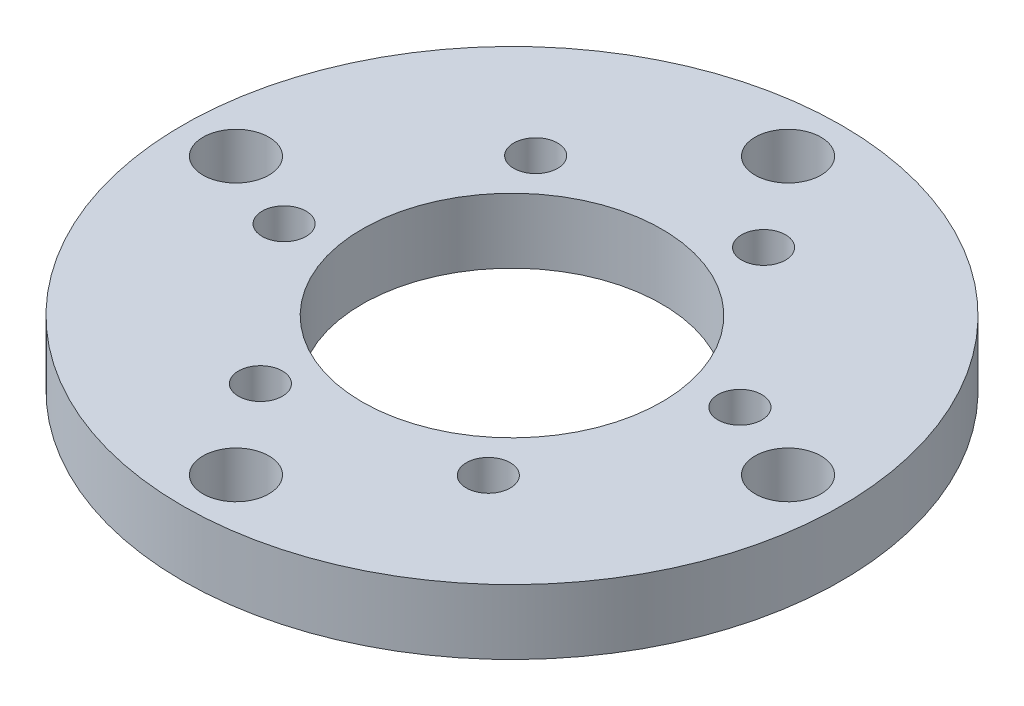
ISO-10303-21;
HEADER;
FILE_DESCRIPTION(('STEP AP214'),'2;1');
FILE_NAME('part.step','',(''),(''),'','','');
FILE_SCHEMA(('AUTOMOTIVE_DESIGN { 1 0 10303 214 1 1 1 1 }'));
ENDSEC;
DATA;
#1=APPLICATION_CONTEXT('core data for automotive mechanical design processes');
#2=APPLICATION_PROTOCOL_DEFINITION('international standard','automotive_design',2000,#1);
#3=PRODUCT_CONTEXT('',#1,'mechanical');
#4=PRODUCT('Part','Part','',(#3));
#5=PRODUCT_RELATED_PRODUCT_CATEGORY('part','',(#4));
#6=PRODUCT_DEFINITION_FORMATION('','',#4);
#7=PRODUCT_DEFINITION_CONTEXT('part definition',#1,'design');
#8=PRODUCT_DEFINITION('design','',#6,#7);
#9=PRODUCT_DEFINITION_SHAPE('','',#8);
#10=(LENGTH_UNIT() NAMED_UNIT(*) SI_UNIT(.MILLI.,.METRE.));
#11=(NAMED_UNIT(*) PLANE_ANGLE_UNIT() SI_UNIT($,.RADIAN.));
#12=(NAMED_UNIT(*) SI_UNIT($,.STERADIAN.) SOLID_ANGLE_UNIT());
#13=UNCERTAINTY_MEASURE_WITH_UNIT(LENGTH_MEASURE(1.E-05),#10,'distance_accuracy_value','');
#14=(GEOMETRIC_REPRESENTATION_CONTEXT(3) GLOBAL_UNCERTAINTY_ASSIGNED_CONTEXT((#13)) GLOBAL_UNIT_ASSIGNED_CONTEXT((#10,
#11,#12)) REPRESENTATION_CONTEXT('',''));
#15=CARTESIAN_POINT('',(0.,0.,0.));
#16=DIRECTION('',(0.,0.,1.));
#17=DIRECTION('',(1.,0.,0.));
#18=AXIS2_PLACEMENT_3D('',#15,#16,#17);
#19=CARTESIAN_POINT('',(0.,0.,0.));
#20=DIRECTION('',(0.,1.,0.));
#21=DIRECTION('',(0.,0.,1.));
#22=AXIS2_PLACEMENT_3D('',#19,#20,#21);
#23=PLANE('',#22);
#24=CARTESIAN_POINT('',(44.45,0.,44.45));
#25=DIRECTION('',(0.,1.,0.));
#26=DIRECTION('',(0.,0.,1.));
#27=AXIS2_PLACEMENT_3D('',#24,#25,#26);
#28=CIRCLE('',#27,19.05);
#29=CARTESIAN_POINT('',(44.45,0.,63.5));
#30=VERTEX_POINT('',#29);
#31=EDGE_CURVE('E109',#30,#30,#28,.T.);
#32=ORIENTED_EDGE('',*,*,#31,.F.);
#33=EDGE_LOOP('',(#32));
#34=FACE_BOUND('',#33,.T.);
#35=CARTESIAN_POINT('',(60.547211679067,0.,63.5588115116649));
#36=DIRECTION('',(0.,1.,0.));
#37=DIRECTION('',(0.86602540378444,0.,0.499999999999998));
#38=AXIS2_PLACEMENT_3D('',#35,#36,#37);
#39=CIRCLE('',#38,2.794);
#40=CARTESIAN_POINT('',(62.9668866572407,0.,64.9558115116649));
#41=VERTEX_POINT('',#40);
#42=EDGE_CURVE('E104',#41,#41,#39,.T.);
#43=ORIENTED_EDGE('',*,*,#42,.F.);
#44=EDGE_LOOP('',(#43));
#45=FACE_BOUND('',#44,.T.);
#46=CARTESIAN_POINT('',(69.0473220447638,0.,40.0638115116648));
#47=DIRECTION('',(0.,1.,0.));
#48=DIRECTION('',(0.866025403784436,0.,-0.500000000000004));
#49=AXIS2_PLACEMENT_3D('',#46,#47,#48);
#50=CIRCLE('',#49,2.794);
#51=CARTESIAN_POINT('',(71.4669970229375,0.,38.6668115116648));
#52=VERTEX_POINT('',#51);
#53=EDGE_CURVE('E98',#52,#52,#50,.T.);
#54=ORIENTED_EDGE('',*,*,#53,.F.);
#55=EDGE_LOOP('',(#54));
#56=FACE_BOUND('',#55,.T.);
#57=CARTESIAN_POINT('',(52.9501103656969,0.,20.955));
#58=DIRECTION('',(0.,1.,0.));
#59=DIRECTION('',(0.,0.,-1.));
#60=AXIS2_PLACEMENT_3D('',#57,#58,#59);
#61=CIRCLE('',#60,2.794);
#62=CARTESIAN_POINT('',(52.9501103656969,0.,18.161));
#63=VERTEX_POINT('',#62);
#64=EDGE_CURVE('E92',#63,#63,#61,.T.);
#65=ORIENTED_EDGE('',*,*,#64,.F.);
#66=EDGE_LOOP('',(#65));
#67=FACE_BOUND('',#66,.T.);
#68=CARTESIAN_POINT('',(28.3527883209329,0.,25.3411884883352));
#69=DIRECTION('',(0.,1.,0.));
#70=DIRECTION('',(-0.866025403784443,0.,-0.499999999999992));
#71=AXIS2_PLACEMENT_3D('',#68,#69,#70);
#72=CIRCLE('',#71,2.794);
#73=CARTESIAN_POINT('',(25.9331133427592,0.,23.9441884883352));
#74=VERTEX_POINT('',#73);
#75=EDGE_CURVE('E86',#74,#74,#72,.T.);
#76=ORIENTED_EDGE('',*,*,#75,.F.);
#77=EDGE_LOOP('',(#76));
#78=FACE_BOUND('',#77,.T.);
#79=CARTESIAN_POINT('',(19.8526779552362,0.,48.8361884883353));
#80=DIRECTION('',(0.,1.,0.));
#81=DIRECTION('',(-0.866025403784433,0.,0.50000000000001));
#82=AXIS2_PLACEMENT_3D('',#79,#80,#81);
#83=CIRCLE('',#82,2.794);
#84=CARTESIAN_POINT('',(17.4330029770625,0.,50.2331884883354));
#85=VERTEX_POINT('',#84);
#86=EDGE_CURVE('E79',#85,#85,#83,.T.);
#87=ORIENTED_EDGE('',*,*,#86,.F.);
#88=EDGE_LOOP('',(#87));
#89=FACE_BOUND('',#88,.T.);
#90=CARTESIAN_POINT('',(35.9498896343031,0.,67.945));
#91=DIRECTION('',(0.,1.,0.));
#92=DIRECTION('',(0.,0.,1.));
#93=AXIS2_PLACEMENT_3D('',#90,#91,#92);
#94=CIRCLE('',#93,2.794);
#95=CARTESIAN_POINT('',(35.9498896343031,0.,70.739));
#96=VERTEX_POINT('',#95);
#97=EDGE_CURVE('E73',#96,#96,#94,.T.);
#98=ORIENTED_EDGE('',*,*,#97,.F.);
#99=EDGE_LOOP('',(#98));
#100=FACE_BOUND('',#99,.T.);
#101=CARTESIAN_POINT('',(79.5528,0.,44.4499999999999));
#102=DIRECTION('',(0.,1.,0.));
#103=DIRECTION('',(1.,0.,0.));
#104=AXIS2_PLACEMENT_3D('',#101,#102,#103);
#105=CIRCLE('',#104,4.191);
#106=CARTESIAN_POINT('',(83.7438,0.,44.4499999999999));
#107=VERTEX_POINT('',#106);
#108=EDGE_CURVE('E68',#107,#107,#105,.T.);
#109=ORIENTED_EDGE('',*,*,#108,.F.);
#110=EDGE_LOOP('',(#109));
#111=FACE_BOUND('',#110,.T.);
#112=CARTESIAN_POINT('',(44.45,0.,9.34719999999997));
#113=DIRECTION('',(0.,1.,0.));
#114=DIRECTION('',(0.,0.,-1.));
#115=AXIS2_PLACEMENT_3D('',#112,#113,#114);
#116=CIRCLE('',#115,4.191);
#117=CARTESIAN_POINT('',(44.45,0.,5.15619999999997));
#118=VERTEX_POINT('',#117);
#119=EDGE_CURVE('E62',#118,#118,#116,.T.);
#120=ORIENTED_EDGE('',*,*,#119,.F.);
#121=EDGE_LOOP('',(#120));
#122=FACE_BOUND('',#121,.T.);
#123=CARTESIAN_POINT('',(9.3472,0.,44.4500000000004));
#124=DIRECTION('',(0.,1.,0.));
#125=DIRECTION('',(-1.,0.,0.));
#126=AXIS2_PLACEMENT_3D('',#123,#124,#125);
#127=CIRCLE('',#126,4.191);
#128=CARTESIAN_POINT('',(5.1562,0.,44.4500000000004));
#129=VERTEX_POINT('',#128);
#130=EDGE_CURVE('E55',#129,#129,#127,.T.);
#131=ORIENTED_EDGE('',*,*,#130,.F.);
#132=EDGE_LOOP('',(#131));
#133=FACE_BOUND('',#132,.T.);
#134=CARTESIAN_POINT('',(44.45,0.,79.5528));
#135=DIRECTION('',(0.,1.,0.));
#136=DIRECTION('',(0.,0.,1.));
#137=AXIS2_PLACEMENT_3D('',#134,#135,#136);
#138=CIRCLE('',#137,4.191);
#139=CARTESIAN_POINT('',(44.45,0.,83.7438));
#140=VERTEX_POINT('',#139);
#141=EDGE_CURVE('E49',#140,#140,#138,.T.);
#142=ORIENTED_EDGE('',*,*,#141,.F.);
#143=EDGE_LOOP('',(#142));
#144=FACE_BOUND('',#143,.T.);
#145=CARTESIAN_POINT('',(44.45,0.,44.45));
#146=DIRECTION('',(0.,1.,0.));
#147=DIRECTION('',(0.,0.,1.));
#148=AXIS2_PLACEMENT_3D('',#145,#146,#147);
#149=CIRCLE('',#148,41.91);
#150=CARTESIAN_POINT('',(44.45,0.,86.36));
#151=VERTEX_POINT('',#150);
#152=EDGE_CURVE('E40',#151,#151,#149,.T.);
#153=ORIENTED_EDGE('',*,*,#152,.T.);
#154=EDGE_LOOP('',(#153));
#155=FACE_BOUND('',#154,.T.);
#156=ADVANCED_FACE('F37',(#34,#45,#56,#67,#78,#89,#100,#111,#122,#133,#144,#155),#23,.T.);
#157=CARTESIAN_POINT('',(44.45,-8.255,44.45));
#158=DIRECTION('',(0.,1.,0.));
#159=DIRECTION('',(0.,0.,1.));
#160=AXIS2_PLACEMENT_3D('',#157,#158,#159);
#161=CYLINDRICAL_SURFACE('',#160,41.91);
#162=CARTESIAN_POINT('',(44.45,-8.255,44.45));
#163=DIRECTION('',(0.,1.,0.));
#164=DIRECTION('',(0.,0.,1.));
#165=AXIS2_PLACEMENT_3D('',#162,#163,#164);
#166=CIRCLE('',#165,41.91);
#167=CARTESIAN_POINT('',(44.45,-8.255,86.36));
#168=VERTEX_POINT('',#167);
#169=EDGE_CURVE('E10',#168,#168,#166,.T.);
#170=ORIENTED_EDGE('',*,*,#169,.T.);
#171=EDGE_LOOP('',(#170));
#172=FACE_BOUND('',#171,.T.);
#173=ORIENTED_EDGE('',*,*,#152,.F.);
#174=EDGE_LOOP('',(#173));
#175=FACE_BOUND('',#174,.T.);
#176=ADVANCED_FACE('F127',(#172,#175),#161,.T.);
#177=CARTESIAN_POINT('',(0.,-8.255,0.));
#178=DIRECTION('',(0.,1.,0.));
#179=DIRECTION('',(0.,0.,1.));
#180=AXIS2_PLACEMENT_3D('',#177,#178,#179);
#181=PLANE('',#180);
#182=CARTESIAN_POINT('',(44.45,-8.255,44.45));
#183=DIRECTION('',(0.,1.,0.));
#184=DIRECTION('',(0.,0.,1.));
#185=AXIS2_PLACEMENT_3D('',#182,#183,#184);
#186=CIRCLE('',#185,19.05);
#187=CARTESIAN_POINT('',(44.45,-8.255,63.5));
#188=VERTEX_POINT('',#187);
#189=EDGE_CURVE('E83',#188,#188,#186,.T.);
#190=ORIENTED_EDGE('',*,*,#189,.T.);
#191=EDGE_LOOP('',(#190));
#192=FACE_BOUND('',#191,.T.);
#193=CARTESIAN_POINT('',(60.547211679067,-8.255,63.5588115116649));
#194=DIRECTION('',(0.,1.,0.));
#195=DIRECTION('',(0.86602540378444,0.,0.499999999999998));
#196=AXIS2_PLACEMENT_3D('',#193,#194,#195);
#197=CIRCLE('',#196,2.794);
#198=CARTESIAN_POINT('',(62.9668866572407,-8.255,64.9558115116649));
#199=VERTEX_POINT('',#198);
#200=EDGE_CURVE('E76',#199,#199,#197,.T.);
#201=ORIENTED_EDGE('',*,*,#200,.T.);
#202=EDGE_LOOP('',(#201));
#203=FACE_BOUND('',#202,.T.);
#204=CARTESIAN_POINT('',(69.0473220447638,-8.255,40.0638115116648));
#205=DIRECTION('',(0.,1.,0.));
#206=DIRECTION('',(0.866025403784436,0.,-0.500000000000004));
#207=AXIS2_PLACEMENT_3D('',#204,#205,#206);
#208=CIRCLE('',#207,2.794);
#209=CARTESIAN_POINT('',(71.4669970229375,-8.255,38.6668115116648));
#210=VERTEX_POINT('',#209);
#211=EDGE_CURVE('E101',#210,#210,#208,.T.);
#212=ORIENTED_EDGE('',*,*,#211,.T.);
#213=EDGE_LOOP('',(#212));
#214=FACE_BOUND('',#213,.T.);
#215=CARTESIAN_POINT('',(52.9501103656969,-8.255,20.955));
#216=DIRECTION('',(0.,1.,0.));
#217=DIRECTION('',(0.,0.,-1.));
#218=AXIS2_PLACEMENT_3D('',#215,#216,#217);
#219=CIRCLE('',#218,2.794);
#220=CARTESIAN_POINT('',(52.9501103656969,-8.255,18.161));
#221=VERTEX_POINT('',#220);
#222=EDGE_CURVE('E95',#221,#221,#219,.T.);
#223=ORIENTED_EDGE('',*,*,#222,.T.);
#224=EDGE_LOOP('',(#223));
#225=FACE_BOUND('',#224,.T.);
#226=CARTESIAN_POINT('',(28.3527883209329,-8.255,25.3411884883352));
#227=DIRECTION('',(0.,1.,0.));
#228=DIRECTION('',(-0.866025403784443,0.,-0.499999999999992));
#229=AXIS2_PLACEMENT_3D('',#226,#227,#228);
#230=CIRCLE('',#229,2.794);
#231=CARTESIAN_POINT('',(25.9331133427592,-8.255,23.9441884883352));
#232=VERTEX_POINT('',#231);
#233=EDGE_CURVE('E89',#232,#232,#230,.T.);
#234=ORIENTED_EDGE('',*,*,#233,.T.);
#235=EDGE_LOOP('',(#234));
#236=FACE_BOUND('',#235,.T.);
#237=CARTESIAN_POINT('',(19.8526779552362,-8.255,48.8361884883353));
#238=DIRECTION('',(0.,1.,0.));
#239=DIRECTION('',(-0.866025403784433,0.,0.50000000000001));
#240=AXIS2_PLACEMENT_3D('',#237,#238,#239);
#241=CIRCLE('',#240,2.794);
#242=CARTESIAN_POINT('',(17.4330029770625,-8.255,50.2331884883354));
#243=VERTEX_POINT('',#242);
#244=EDGE_CURVE('E82',#243,#243,#241,.T.);
#245=ORIENTED_EDGE('',*,*,#244,.T.);
#246=EDGE_LOOP('',(#245));
#247=FACE_BOUND('',#246,.T.);
#248=CARTESIAN_POINT('',(35.9498896343031,-8.255,67.945));
#249=DIRECTION('',(0.,1.,0.));
#250=DIRECTION('',(0.,0.,1.));
#251=AXIS2_PLACEMENT_3D('',#248,#249,#250);
#252=CIRCLE('',#251,2.794);
#253=CARTESIAN_POINT('',(35.9498896343031,-8.255,70.739));
#254=VERTEX_POINT('',#253);
#255=EDGE_CURVE('E59',#254,#254,#252,.T.);
#256=ORIENTED_EDGE('',*,*,#255,.T.);
#257=EDGE_LOOP('',(#256));
#258=FACE_BOUND('',#257,.T.);
#259=CARTESIAN_POINT('',(79.5528,-8.255,44.4499999999999));
#260=DIRECTION('',(0.,1.,0.));
#261=DIRECTION('',(1.,0.,0.));
#262=AXIS2_PLACEMENT_3D('',#259,#260,#261);
#263=CIRCLE('',#262,4.191);
#264=CARTESIAN_POINT('',(83.7438,-8.255,44.4499999999999));
#265=VERTEX_POINT('',#264);
#266=EDGE_CURVE('E52',#265,#265,#263,.T.);
#267=ORIENTED_EDGE('',*,*,#266,.T.);
#268=EDGE_LOOP('',(#267));
#269=FACE_BOUND('',#268,.T.);
#270=CARTESIAN_POINT('',(44.45,-8.255,9.34719999999997));
#271=DIRECTION('',(0.,1.,0.));
#272=DIRECTION('',(0.,0.,-1.));
#273=AXIS2_PLACEMENT_3D('',#270,#271,#272);
#274=CIRCLE('',#273,4.191);
#275=CARTESIAN_POINT('',(44.45,-8.255,5.15619999999997));
#276=VERTEX_POINT('',#275);
#277=EDGE_CURVE('E65',#276,#276,#274,.T.);
#278=ORIENTED_EDGE('',*,*,#277,.T.);
#279=EDGE_LOOP('',(#278));
#280=FACE_BOUND('',#279,.T.);
#281=CARTESIAN_POINT('',(9.3472,-8.255,44.4500000000004));
#282=DIRECTION('',(0.,1.,0.));
#283=DIRECTION('',(-1.,0.,0.));
#284=AXIS2_PLACEMENT_3D('',#281,#282,#283);
#285=CIRCLE('',#284,4.191);
#286=CARTESIAN_POINT('',(5.1562,-8.255,44.4500000000004));
#287=VERTEX_POINT('',#286);
#288=EDGE_CURVE('E58',#287,#287,#285,.T.);
#289=ORIENTED_EDGE('',*,*,#288,.T.);
#290=EDGE_LOOP('',(#289));
#291=FACE_BOUND('',#290,.T.);
#292=CARTESIAN_POINT('',(44.45,-8.255,79.5528));
#293=DIRECTION('',(0.,1.,0.));
#294=DIRECTION('',(0.,0.,1.));
#295=AXIS2_PLACEMENT_3D('',#292,#293,#294);
#296=CIRCLE('',#295,4.191);
#297=CARTESIAN_POINT('',(44.45,-8.255,83.7438));
#298=VERTEX_POINT('',#297);
#299=EDGE_CURVE('E47',#298,#298,#296,.T.);
#300=ORIENTED_EDGE('',*,*,#299,.T.);
#301=EDGE_LOOP('',(#300));
#302=FACE_BOUND('',#301,.T.);
#303=ORIENTED_EDGE('',*,*,#169,.F.);
#304=EDGE_LOOP('',(#303));
#305=FACE_BOUND('',#304,.T.);
#306=ADVANCED_FACE('F115',(#192,#203,#214,#225,#236,#247,#258,#269,#280,#291,#302,#305),#181,.F.);
#307=CARTESIAN_POINT('',(44.45,-8.255,79.5528));
#308=DIRECTION('',(0.,1.,0.));
#309=DIRECTION('',(0.,0.,1.));
#310=AXIS2_PLACEMENT_3D('',#307,#308,#309);
#311=CYLINDRICAL_SURFACE('',#310,4.191);
#312=ORIENTED_EDGE('',*,*,#299,.F.);
#313=EDGE_LOOP('',(#312));
#314=FACE_BOUND('',#313,.T.);
#315=ORIENTED_EDGE('',*,*,#141,.T.);
#316=EDGE_LOOP('',(#315));
#317=FACE_BOUND('',#316,.T.);
#318=ADVANCED_FACE('F155',(#314,#317),#311,.F.);
#319=CARTESIAN_POINT('',(9.3472,-8.255,44.4500000000004));
#320=DIRECTION('',(0.,1.,0.));
#321=DIRECTION('',(0.,0.,1.));
#322=AXIS2_PLACEMENT_3D('',#319,#320,#321);
#323=CYLINDRICAL_SURFACE('',#322,4.191);
#324=ORIENTED_EDGE('',*,*,#288,.F.);
#325=EDGE_LOOP('',(#324));
#326=FACE_BOUND('',#325,.T.);
#327=ORIENTED_EDGE('',*,*,#130,.T.);
#328=EDGE_LOOP('',(#327));
#329=FACE_BOUND('',#328,.T.);
#330=ADVANCED_FACE('F159',(#326,#329),#323,.F.);
#331=CARTESIAN_POINT('',(44.45,-8.255,9.34719999999997));
#332=DIRECTION('',(0.,1.,0.));
#333=DIRECTION('',(0.,0.,1.));
#334=AXIS2_PLACEMENT_3D('',#331,#332,#333);
#335=CYLINDRICAL_SURFACE('',#334,4.191);
#336=ORIENTED_EDGE('',*,*,#277,.F.);
#337=EDGE_LOOP('',(#336));
#338=FACE_BOUND('',#337,.T.);
#339=ORIENTED_EDGE('',*,*,#119,.T.);
#340=EDGE_LOOP('',(#339));
#341=FACE_BOUND('',#340,.T.);
#342=ADVANCED_FACE('F163',(#338,#341),#335,.F.);
#343=CARTESIAN_POINT('',(79.5528,-8.255,44.4499999999999));
#344=DIRECTION('',(0.,1.,0.));
#345=DIRECTION('',(0.,0.,1.));
#346=AXIS2_PLACEMENT_3D('',#343,#344,#345);
#347=CYLINDRICAL_SURFACE('',#346,4.191);
#348=ORIENTED_EDGE('',*,*,#266,.F.);
#349=EDGE_LOOP('',(#348));
#350=FACE_BOUND('',#349,.T.);
#351=ORIENTED_EDGE('',*,*,#108,.T.);
#352=EDGE_LOOP('',(#351));
#353=FACE_BOUND('',#352,.T.);
#354=ADVANCED_FACE('F167',(#350,#353),#347,.F.);
#355=CARTESIAN_POINT('',(35.9498896343031,-8.255,67.945));
#356=DIRECTION('',(0.,1.,0.));
#357=DIRECTION('',(0.,0.,1.));
#358=AXIS2_PLACEMENT_3D('',#355,#356,#357);
#359=CYLINDRICAL_SURFACE('',#358,2.794);
#360=ORIENTED_EDGE('',*,*,#255,.F.);
#361=EDGE_LOOP('',(#360));
#362=FACE_BOUND('',#361,.T.);
#363=ORIENTED_EDGE('',*,*,#97,.T.);
#364=EDGE_LOOP('',(#363));
#365=FACE_BOUND('',#364,.T.);
#366=ADVANCED_FACE('F171',(#362,#365),#359,.F.);
#367=CARTESIAN_POINT('',(19.8526779552362,-8.255,48.8361884883353));
#368=DIRECTION('',(0.,1.,0.));
#369=DIRECTION('',(0.,0.,1.));
#370=AXIS2_PLACEMENT_3D('',#367,#368,#369);
#371=CYLINDRICAL_SURFACE('',#370,2.794);
#372=ORIENTED_EDGE('',*,*,#244,.F.);
#373=EDGE_LOOP('',(#372));
#374=FACE_BOUND('',#373,.T.);
#375=ORIENTED_EDGE('',*,*,#86,.T.);
#376=EDGE_LOOP('',(#375));
#377=FACE_BOUND('',#376,.T.);
#378=ADVANCED_FACE('F175',(#374,#377),#371,.F.);
#379=CARTESIAN_POINT('',(28.3527883209329,-8.255,25.3411884883352));
#380=DIRECTION('',(0.,1.,0.));
#381=DIRECTION('',(0.,0.,1.));
#382=AXIS2_PLACEMENT_3D('',#379,#380,#381);
#383=CYLINDRICAL_SURFACE('',#382,2.794);
#384=ORIENTED_EDGE('',*,*,#233,.F.);
#385=EDGE_LOOP('',(#384));
#386=FACE_BOUND('',#385,.T.);
#387=ORIENTED_EDGE('',*,*,#75,.T.);
#388=EDGE_LOOP('',(#387));
#389=FACE_BOUND('',#388,.T.);
#390=ADVANCED_FACE('F179',(#386,#389),#383,.F.);
#391=CARTESIAN_POINT('',(52.9501103656969,-8.255,20.955));
#392=DIRECTION('',(0.,1.,0.));
#393=DIRECTION('',(0.,0.,1.));
#394=AXIS2_PLACEMENT_3D('',#391,#392,#393);
#395=CYLINDRICAL_SURFACE('',#394,2.794);
#396=ORIENTED_EDGE('',*,*,#222,.F.);
#397=EDGE_LOOP('',(#396));
#398=FACE_BOUND('',#397,.T.);
#399=ORIENTED_EDGE('',*,*,#64,.T.);
#400=EDGE_LOOP('',(#399));
#401=FACE_BOUND('',#400,.T.);
#402=ADVANCED_FACE('F183',(#398,#401),#395,.F.);
#403=CARTESIAN_POINT('',(69.0473220447638,-8.255,40.0638115116648));
#404=DIRECTION('',(0.,1.,0.));
#405=DIRECTION('',(0.,0.,1.));
#406=AXIS2_PLACEMENT_3D('',#403,#404,#405);
#407=CYLINDRICAL_SURFACE('',#406,2.794);
#408=ORIENTED_EDGE('',*,*,#211,.F.);
#409=EDGE_LOOP('',(#408));
#410=FACE_BOUND('',#409,.T.);
#411=ORIENTED_EDGE('',*,*,#53,.T.);
#412=EDGE_LOOP('',(#411));
#413=FACE_BOUND('',#412,.T.);
#414=ADVANCED_FACE('F187',(#410,#413),#407,.F.);
#415=CARTESIAN_POINT('',(60.547211679067,-8.255,63.5588115116649));
#416=DIRECTION('',(0.,1.,0.));
#417=DIRECTION('',(0.,0.,1.));
#418=AXIS2_PLACEMENT_3D('',#415,#416,#417);
#419=CYLINDRICAL_SURFACE('',#418,2.794);
#420=ORIENTED_EDGE('',*,*,#200,.F.);
#421=EDGE_LOOP('',(#420));
#422=FACE_BOUND('',#421,.T.);
#423=ORIENTED_EDGE('',*,*,#42,.T.);
#424=EDGE_LOOP('',(#423));
#425=FACE_BOUND('',#424,.T.);
#426=ADVANCED_FACE('F121',(#422,#425),#419,.F.);
#427=CARTESIAN_POINT('',(44.45,-8.255,44.45));
#428=DIRECTION('',(0.,1.,0.));
#429=DIRECTION('',(0.,0.,1.));
#430=AXIS2_PLACEMENT_3D('',#427,#428,#429);
#431=CYLINDRICAL_SURFACE('',#430,19.05);
#432=ORIENTED_EDGE('',*,*,#189,.F.);
#433=EDGE_LOOP('',(#432));
#434=FACE_BOUND('',#433,.T.);
#435=ORIENTED_EDGE('',*,*,#31,.T.);
#436=EDGE_LOOP('',(#435));
#437=FACE_BOUND('',#436,.T.);
#438=ADVANCED_FACE('F118',(#434,#437),#431,.F.);
#439=CLOSED_SHELL('',(#156,#176,#306,#318,#330,#342,#354,#366,#378,#390,#402,#414,#426,#438));
#440=MANIFOLD_SOLID_BREP('B2',#439);
#441=ADVANCED_BREP_SHAPE_REPRESENTATION('',(#18,#440),#14);
#442=SHAPE_DEFINITION_REPRESENTATION(#9,#441);
ENDSEC;
END-ISO-10303-21;
